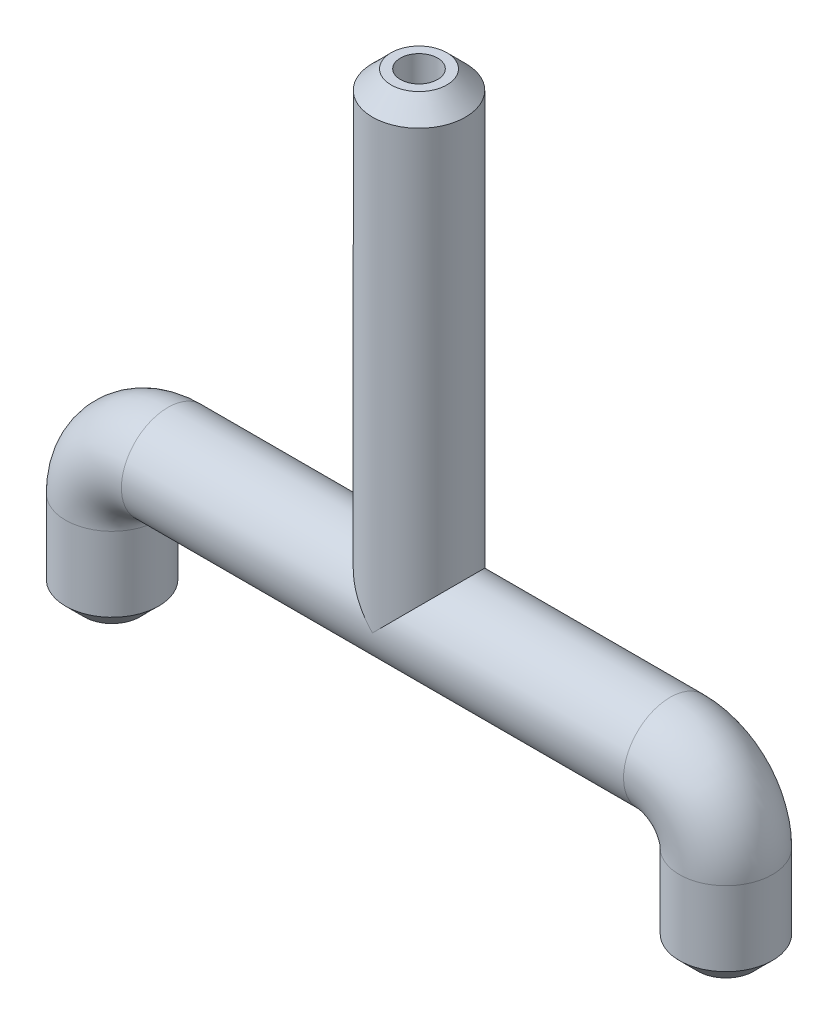
ISO-10303-21;
HEADER;
FILE_DESCRIPTION(('STEP AP214'),'2;1');
FILE_NAME('part.step','',(''),(''),'','','');
FILE_SCHEMA(('AUTOMOTIVE_DESIGN { 1 0 10303 214 1 1 1 1 }'));
ENDSEC;
DATA;
#1=APPLICATION_CONTEXT('core data for automotive mechanical design processes');
#2=APPLICATION_PROTOCOL_DEFINITION('international standard','automotive_design',2000,#1);
#3=PRODUCT_CONTEXT('',#1,'mechanical');
#4=PRODUCT('Part','Part','',(#3));
#5=PRODUCT_RELATED_PRODUCT_CATEGORY('part','',(#4));
#6=PRODUCT_DEFINITION_FORMATION('','',#4);
#7=PRODUCT_DEFINITION_CONTEXT('part definition',#1,'design');
#8=PRODUCT_DEFINITION('design','',#6,#7);
#9=PRODUCT_DEFINITION_SHAPE('','',#8);
#10=(LENGTH_UNIT() NAMED_UNIT(*) SI_UNIT(.MILLI.,.METRE.));
#11=(NAMED_UNIT(*) PLANE_ANGLE_UNIT() SI_UNIT($,.RADIAN.));
#12=(NAMED_UNIT(*) SI_UNIT($,.STERADIAN.) SOLID_ANGLE_UNIT());
#13=UNCERTAINTY_MEASURE_WITH_UNIT(LENGTH_MEASURE(1.E-05),#10,'distance_accuracy_value','');
#14=(GEOMETRIC_REPRESENTATION_CONTEXT(3) GLOBAL_UNCERTAINTY_ASSIGNED_CONTEXT((#13)) GLOBAL_UNIT_ASSIGNED_CONTEXT((#10,
#11,#12)) REPRESENTATION_CONTEXT('',''));
#15=CARTESIAN_POINT('',(0.,0.,0.));
#16=DIRECTION('',(0.,0.,1.));
#17=DIRECTION('',(1.,0.,0.));
#18=AXIS2_PLACEMENT_3D('',#15,#16,#17);
#19=CARTESIAN_POINT('',(-16.4902224556055,29.75,-8.5));
#20=DIRECTION('',(0.,1.,0.));
#21=DIRECTION('',(0.,0.,1.));
#22=AXIS2_PLACEMENT_3D('',#19,#20,#21);
#23=CYLINDRICAL_SURFACE('',#22,2.5);
#24=CARTESIAN_POINT('',(-16.4902224556055,30.75,-8.5));
#25=DIRECTION('',(0.,1.,0.));
#26=DIRECTION('',(0.,0.,1.));
#27=AXIS2_PLACEMENT_3D('',#24,#25,#26);
#28=CIRCLE('',#27,2.5);
#29=CARTESIAN_POINT('',(-16.4902224556055,30.75,-6.));
#30=VERTEX_POINT('',#29);
#31=EDGE_CURVE('E99',#30,#30,#28,.T.);
#32=ORIENTED_EDGE('',*,*,#31,.T.);
#33=EDGE_LOOP('',(#32));
#34=FACE_BOUND('',#33,.T.);
#35=CARTESIAN_POINT('',(-16.4902224556055,34.75,-8.5));
#36=DIRECTION('',(0.,1.,0.));
#37=DIRECTION('',(0.,0.,-1.));
#38=AXIS2_PLACEMENT_3D('',#35,#36,#37);
#39=CIRCLE('',#38,2.5);
#40=CARTESIAN_POINT('',(-18.9902224556055,34.75,-8.5));
#41=VERTEX_POINT('',#40);
#42=EDGE_CURVE('E79',#41,#41,#39,.T.);
#43=ORIENTED_EDGE('',*,*,#42,.F.);
#44=EDGE_LOOP('',(#43));
#45=FACE_BOUND('',#44,.T.);
#46=ADVANCED_FACE('F34',(#34,#45),#23,.T.);
#47=CARTESIAN_POINT('',(-13.4902224556055,34.75,-8.5));
#48=DIRECTION('',(0.,0.,-1.));
#49=DIRECTION('',(-1.,0.,0.));
#50=AXIS2_PLACEMENT_3D('',#47,#48,#49);
#51=TOROIDAL_SURFACE('',#50,3.,2.5);
#52=CARTESIAN_POINT('',(-13.4902224556055,37.75,-8.5));
#53=DIRECTION('',(1.,0.,0.));
#54=DIRECTION('',(0.,0.,-1.));
#55=AXIS2_PLACEMENT_3D('',#52,#53,#54);
#56=CIRCLE('',#55,2.5);
#57=CARTESIAN_POINT('',(-13.4902224556055,40.25,-8.5));
#58=VERTEX_POINT('',#57);
#59=EDGE_CURVE('E102',#58,#58,#56,.T.);
#60=CARTESIAN_POINT('',(-13.4902224556055,34.75,-8.5));
#61=DIRECTION('',(0.,0.,-1.));
#62=DIRECTION('',(-1.,0.,0.));
#63=AXIS2_PLACEMENT_3D('',#60,#61,#62);
#64=CIRCLE('',#63,5.5);
#65=EDGE_CURVE('',#41,#58,#64,.T.);
#66=ORIENTED_EDGE('',*,*,#42,.T.);
#67=ORIENTED_EDGE('',*,*,#59,.F.);
#68=ORIENTED_EDGE('',*,*,#65,.T.);
#69=ORIENTED_EDGE('',*,*,#65,.F.);
#70=EDGE_LOOP('',(#66,#68,#67,#69));
#71=FACE_BOUND('',#70,.T.);
#72=ADVANCED_FACE('F164',(#71),#51,.T.);
#73=CARTESIAN_POINT('',(-13.4902224556055,37.75,-8.5));
#74=DIRECTION('',(1.,0.,0.));
#75=DIRECTION('',(0.,0.,-1.));
#76=AXIS2_PLACEMENT_3D('',#73,#74,#75);
#77=CYLINDRICAL_SURFACE('',#76,2.5);
#78=CARTESIAN_POINT('',(0.,37.75,-8.5));
#79=DIRECTION('',(0.707106781186547,0.707106781186547,0.));
#80=DIRECTION('',(-0.707106781186547,0.707106781186547,0.));
#81=AXIS2_PLACEMENT_3D('',#78,#79,#80);
#82=ELLIPSE('',#81,3.53553390593274,2.5);
#83=CARTESIAN_POINT('',(0.,37.75,-6.));
#84=VERTEX_POINT('',#83);
#85=CARTESIAN_POINT('',(0.,37.75,-11.));
#86=VERTEX_POINT('',#85);
#87=EDGE_CURVE('E73',#84,#86,#82,.F.);
#88=ORIENTED_EDGE('',*,*,#87,.T.);
#89=CARTESIAN_POINT('',(0.,37.75,-8.5));
#90=DIRECTION('',(-0.707106781186547,0.707106781186547,0.));
#91=DIRECTION('',(0.707106781186547,0.707106781186547,0.));
#92=AXIS2_PLACEMENT_3D('',#89,#90,#91);
#93=ELLIPSE('',#92,3.53553390593274,2.5);
#94=EDGE_CURVE('E55',#86,#84,#93,.F.);
#95=ORIENTED_EDGE('',*,*,#94,.T.);
#96=EDGE_LOOP('',(#88,#95));
#97=FACE_BOUND('',#96,.T.);
#98=CARTESIAN_POINT('',(13.4902224556055,37.75,-8.5));
#99=DIRECTION('',(1.,0.,0.));
#100=DIRECTION('',(0.,0.,-1.));
#101=AXIS2_PLACEMENT_3D('',#98,#99,#100);
#102=CIRCLE('',#101,2.5);
#103=CARTESIAN_POINT('',(13.4902224556055,40.25,-8.5));
#104=VERTEX_POINT('',#103);
#105=EDGE_CURVE('E105',#104,#104,#102,.T.);
#106=ORIENTED_EDGE('',*,*,#105,.F.);
#107=EDGE_LOOP('',(#106));
#108=FACE_BOUND('',#107,.T.);
#109=ORIENTED_EDGE('',*,*,#59,.T.);
#110=EDGE_LOOP('',(#109));
#111=FACE_BOUND('',#110,.T.);
#112=ADVANCED_FACE('F168',(#97,#108,#111),#77,.T.);
#113=CARTESIAN_POINT('',(13.4902224556055,34.75,-8.5));
#114=DIRECTION('',(0.,0.,-1.));
#115=DIRECTION('',(-1.,0.,0.));
#116=AXIS2_PLACEMENT_3D('',#113,#114,#115);
#117=TOROIDAL_SURFACE('',#116,3.,2.5);
#118=CARTESIAN_POINT('',(16.4902224556055,34.75,-8.5));
#119=DIRECTION('',(0.,-1.,0.));
#120=DIRECTION('',(0.,0.,-1.));
#121=AXIS2_PLACEMENT_3D('',#118,#119,#120);
#122=CIRCLE('',#121,2.5);
#123=CARTESIAN_POINT('',(18.9902224556055,34.75,-8.5));
#124=VERTEX_POINT('',#123);
#125=EDGE_CURVE('E85',#124,#124,#122,.T.);
#126=CARTESIAN_POINT('',(13.4902224556055,34.75,-8.5));
#127=DIRECTION('',(0.,0.,-1.));
#128=DIRECTION('',(-1.,0.,0.));
#129=AXIS2_PLACEMENT_3D('',#126,#127,#128);
#130=CIRCLE('',#129,5.5);
#131=EDGE_CURVE('',#104,#124,#130,.T.);
#132=ORIENTED_EDGE('',*,*,#105,.T.);
#133=ORIENTED_EDGE('',*,*,#125,.F.);
#134=ORIENTED_EDGE('',*,*,#131,.T.);
#135=ORIENTED_EDGE('',*,*,#131,.F.);
#136=EDGE_LOOP('',(#132,#134,#133,#135));
#137=FACE_BOUND('',#136,.T.);
#138=ADVANCED_FACE('F172',(#137),#117,.T.);
#139=CARTESIAN_POINT('',(16.4902224556055,34.75,-8.5));
#140=DIRECTION('',(0.,-1.,0.));
#141=DIRECTION('',(0.,0.,-1.));
#142=AXIS2_PLACEMENT_3D('',#139,#140,#141);
#143=CYLINDRICAL_SURFACE('',#142,2.5);
#144=CARTESIAN_POINT('',(16.4902224556055,30.75,-8.5));
#145=DIRECTION('',(0.,-1.,0.));
#146=DIRECTION('',(0.,0.,-1.));
#147=AXIS2_PLACEMENT_3D('',#144,#145,#146);
#148=CIRCLE('',#147,2.5);
#149=CARTESIAN_POINT('',(16.4902224556055,30.75,-11.));
#150=VERTEX_POINT('',#149);
#151=EDGE_CURVE('E118',#150,#150,#148,.F.);
#152=ORIENTED_EDGE('',*,*,#151,.T.);
#153=EDGE_LOOP('',(#152));
#154=FACE_BOUND('',#153,.T.);
#155=ORIENTED_EDGE('',*,*,#125,.T.);
#156=EDGE_LOOP('',(#155));
#157=FACE_BOUND('',#156,.T.);
#158=ADVANCED_FACE('F160',(#154,#157),#143,.T.);
#159=CARTESIAN_POINT('',(-16.4902224556055,29.75,-8.5));
#160=DIRECTION('',(0.,1.,0.));
#161=DIRECTION('',(0.,0.,-1.));
#162=AXIS2_PLACEMENT_3D('',#159,#160,#161);
#163=PLANE('',#162);
#164=CARTESIAN_POINT('',(-16.4902224556055,29.75,-8.5));
#165=DIRECTION('',(0.,1.,0.));
#166=DIRECTION('',(0.,0.,1.));
#167=AXIS2_PLACEMENT_3D('',#164,#165,#166);
#168=CIRCLE('',#167,1.5);
#169=CARTESIAN_POINT('',(-16.4902224556055,29.75,-7.));
#170=VERTEX_POINT('',#169);
#171=EDGE_CURVE('E112',#170,#170,#168,.F.);
#172=ORIENTED_EDGE('',*,*,#171,.T.);
#173=EDGE_LOOP('',(#172));
#174=FACE_BOUND('',#173,.T.);
#175=CARTESIAN_POINT('',(-16.4902224556055,29.75,-8.5));
#176=DIRECTION('',(0.,1.,0.));
#177=DIRECTION('',(0.,0.,-1.));
#178=AXIS2_PLACEMENT_3D('',#175,#176,#177);
#179=CIRCLE('',#178,1.);
#180=CARTESIAN_POINT('',(-16.4902224556055,29.75,-9.50000000000001));
#181=VERTEX_POINT('',#180);
#182=EDGE_CURVE('E81',#181,#181,#179,.F.);
#183=ORIENTED_EDGE('',*,*,#182,.F.);
#184=EDGE_LOOP('',(#183));
#185=FACE_BOUND('',#184,.T.);
#186=ADVANCED_FACE('F156',(#174,#185),#163,.F.);
#187=CARTESIAN_POINT('',(16.4902224556055,29.75,-8.5));
#188=DIRECTION('',(0.,-1.,0.));
#189=DIRECTION('',(0.,0.,-1.));
#190=AXIS2_PLACEMENT_3D('',#187,#188,#189);
#191=PLANE('',#190);
#192=CARTESIAN_POINT('',(16.4902224556055,29.75,-8.5));
#193=DIRECTION('',(0.,-1.,0.));
#194=DIRECTION('',(0.,0.,-1.));
#195=AXIS2_PLACEMENT_3D('',#192,#193,#194);
#196=CIRCLE('',#195,1.49999999999999);
#197=CARTESIAN_POINT('',(16.4902224556055,29.75,-10.));
#198=VERTEX_POINT('',#197);
#199=EDGE_CURVE('E115',#198,#198,#196,.T.);
#200=ORIENTED_EDGE('',*,*,#199,.T.);
#201=EDGE_LOOP('',(#200));
#202=FACE_BOUND('',#201,.T.);
#203=CARTESIAN_POINT('',(16.4902224556055,29.75,-8.5));
#204=DIRECTION('',(0.,-1.,0.));
#205=DIRECTION('',(0.,0.,-1.));
#206=AXIS2_PLACEMENT_3D('',#203,#204,#205);
#207=CIRCLE('',#206,1.);
#208=CARTESIAN_POINT('',(16.4902224556055,29.75,-9.50000000000001));
#209=VERTEX_POINT('',#208);
#210=EDGE_CURVE('E97',#209,#209,#207,.F.);
#211=ORIENTED_EDGE('',*,*,#210,.T.);
#212=EDGE_LOOP('',(#211));
#213=FACE_BOUND('',#212,.T.);
#214=ADVANCED_FACE('F152',(#202,#213),#191,.T.);
#215=CARTESIAN_POINT('',(-16.4902224556055,29.75,-8.5));
#216=DIRECTION('',(0.,1.,0.));
#217=DIRECTION('',(0.,0.,1.));
#218=AXIS2_PLACEMENT_3D('',#215,#216,#217);
#219=CYLINDRICAL_SURFACE('',#218,1.);
#220=CARTESIAN_POINT('',(-16.4902224556055,34.75,-8.5));
#221=DIRECTION('',(0.,1.,0.));
#222=DIRECTION('',(0.,0.,-1.));
#223=AXIS2_PLACEMENT_3D('',#220,#221,#222);
#224=CIRCLE('',#223,1.);
#225=CARTESIAN_POINT('',(-17.4902224556055,34.75,-8.5));
#226=VERTEX_POINT('',#225);
#227=EDGE_CURVE('E84',#226,#226,#224,.F.);
#228=ORIENTED_EDGE('',*,*,#227,.F.);
#229=EDGE_LOOP('',(#228));
#230=FACE_BOUND('',#229,.T.);
#231=ORIENTED_EDGE('',*,*,#182,.T.);
#232=EDGE_LOOP('',(#231));
#233=FACE_BOUND('',#232,.T.);
#234=ADVANCED_FACE('F155',(#230,#233),#219,.F.);
#235=CARTESIAN_POINT('',(-13.4902224556055,34.75,-8.5));
#236=DIRECTION('',(0.,0.,-1.));
#237=DIRECTION('',(-1.,0.,0.));
#238=AXIS2_PLACEMENT_3D('',#235,#236,#237);
#239=TOROIDAL_SURFACE('',#238,3.,1.);
#240=CARTESIAN_POINT('',(-13.4902224556055,37.75,-8.5));
#241=DIRECTION('',(1.,0.,0.));
#242=DIRECTION('',(0.,0.,-1.));
#243=AXIS2_PLACEMENT_3D('',#240,#241,#242);
#244=CIRCLE('',#243,1.);
#245=CARTESIAN_POINT('',(-13.4902224556055,38.75,-8.5));
#246=VERTEX_POINT('',#245);
#247=EDGE_CURVE('E88',#246,#246,#244,.F.);
#248=CARTESIAN_POINT('',(-13.4902224556055,34.75,-8.5));
#249=DIRECTION('',(0.,0.,-1.));
#250=DIRECTION('',(-1.,0.,0.));
#251=AXIS2_PLACEMENT_3D('',#248,#249,#250);
#252=CIRCLE('',#251,4.);
#253=EDGE_CURVE('',#226,#246,#252,.T.);
#254=ORIENTED_EDGE('',*,*,#227,.T.);
#255=ORIENTED_EDGE('',*,*,#247,.F.);
#256=ORIENTED_EDGE('',*,*,#253,.T.);
#257=ORIENTED_EDGE('',*,*,#253,.F.);
#258=EDGE_LOOP('',(#254,#256,#255,#257));
#259=FACE_BOUND('',#258,.T.);
#260=ADVANCED_FACE('F195',(#259),#239,.F.);
#261=CARTESIAN_POINT('',(-13.4902224556055,37.75,-8.5));
#262=DIRECTION('',(1.,0.,0.));
#263=DIRECTION('',(0.,0.,-1.));
#264=AXIS2_PLACEMENT_3D('',#261,#262,#263);
#265=CYLINDRICAL_SURFACE('',#264,1.);
#266=CARTESIAN_POINT('',(0.,37.75,-8.5));
#267=DIRECTION('',(0.707106781186547,0.707106781186547,0.));
#268=DIRECTION('',(-0.707106781186547,0.707106781186547,0.));
#269=AXIS2_PLACEMENT_3D('',#266,#267,#268);
#270=ELLIPSE('',#269,1.4142135623731,1.);
#271=CARTESIAN_POINT('',(0.,37.75,-9.5));
#272=VERTEX_POINT('',#271);
#273=CARTESIAN_POINT('',(0.,37.75,-7.5));
#274=VERTEX_POINT('',#273);
#275=EDGE_CURVE('E48',#272,#274,#270,.T.);
#276=ORIENTED_EDGE('',*,*,#275,.T.);
#277=CARTESIAN_POINT('',(0.,37.75,-8.5));
#278=DIRECTION('',(-0.707106781186547,0.707106781186547,0.));
#279=DIRECTION('',(0.707106781186547,0.707106781186547,0.));
#280=AXIS2_PLACEMENT_3D('',#277,#278,#279);
#281=ELLIPSE('',#280,1.4142135623731,1.);
#282=EDGE_CURVE('E66',#274,#272,#281,.T.);
#283=ORIENTED_EDGE('',*,*,#282,.T.);
#284=EDGE_LOOP('',(#276,#283));
#285=FACE_BOUND('',#284,.T.);
#286=CARTESIAN_POINT('',(13.4902224556055,37.75,-8.5));
#287=DIRECTION('',(1.,0.,0.));
#288=DIRECTION('',(0.,0.,-1.));
#289=AXIS2_PLACEMENT_3D('',#286,#287,#288);
#290=CIRCLE('',#289,1.);
#291=CARTESIAN_POINT('',(13.4902224556055,38.75,-8.5));
#292=VERTEX_POINT('',#291);
#293=EDGE_CURVE('E91',#292,#292,#290,.F.);
#294=ORIENTED_EDGE('',*,*,#293,.F.);
#295=EDGE_LOOP('',(#294));
#296=FACE_BOUND('',#295,.T.);
#297=ORIENTED_EDGE('',*,*,#247,.T.);
#298=EDGE_LOOP('',(#297));
#299=FACE_BOUND('',#298,.T.);
#300=ADVANCED_FACE('F70',(#285,#296,#299),#265,.F.);
#301=CARTESIAN_POINT('',(13.4902224556055,34.75,-8.5));
#302=DIRECTION('',(0.,0.,-1.));
#303=DIRECTION('',(-1.,0.,0.));
#304=AXIS2_PLACEMENT_3D('',#301,#302,#303);
#305=TOROIDAL_SURFACE('',#304,3.,1.);
#306=CARTESIAN_POINT('',(16.4902224556055,34.75,-8.5));
#307=DIRECTION('',(0.,-1.,0.));
#308=DIRECTION('',(0.,0.,-1.));
#309=AXIS2_PLACEMENT_3D('',#306,#307,#308);
#310=CIRCLE('',#309,1.);
#311=CARTESIAN_POINT('',(17.4902224556055,34.75,-8.5));
#312=VERTEX_POINT('',#311);
#313=EDGE_CURVE('E94',#312,#312,#310,.F.);
#314=CARTESIAN_POINT('',(13.4902224556055,34.75,-8.5));
#315=DIRECTION('',(0.,0.,-1.));
#316=DIRECTION('',(-1.,0.,0.));
#317=AXIS2_PLACEMENT_3D('',#314,#315,#316);
#318=CIRCLE('',#317,4.00000000000001);
#319=EDGE_CURVE('',#292,#312,#318,.T.);
#320=ORIENTED_EDGE('',*,*,#293,.T.);
#321=ORIENTED_EDGE('',*,*,#313,.F.);
#322=ORIENTED_EDGE('',*,*,#319,.T.);
#323=ORIENTED_EDGE('',*,*,#319,.F.);
#324=EDGE_LOOP('',(#320,#322,#321,#323));
#325=FACE_BOUND('',#324,.T.);
#326=ADVANCED_FACE('F137',(#325),#305,.F.);
#327=CARTESIAN_POINT('',(16.4902224556055,34.75,-8.5));
#328=DIRECTION('',(0.,-1.,0.));
#329=DIRECTION('',(0.,0.,-1.));
#330=AXIS2_PLACEMENT_3D('',#327,#328,#329);
#331=CYLINDRICAL_SURFACE('',#330,1.);
#332=ORIENTED_EDGE('',*,*,#210,.F.);
#333=EDGE_LOOP('',(#332));
#334=FACE_BOUND('',#333,.T.);
#335=ORIENTED_EDGE('',*,*,#313,.T.);
#336=EDGE_LOOP('',(#335));
#337=FACE_BOUND('',#336,.T.);
#338=ADVANCED_FACE('F135',(#334,#337),#331,.F.);
#339=CARTESIAN_POINT('',(0.,62.75,-8.5));
#340=DIRECTION('',(0.,1.,0.));
#341=DIRECTION('',(0.,0.,1.));
#342=AXIS2_PLACEMENT_3D('',#339,#340,#341);
#343=PLANE('',#342);
#344=CARTESIAN_POINT('',(0.,62.75,-8.5));
#345=DIRECTION('',(0.,1.,0.));
#346=DIRECTION('',(0.,0.,1.));
#347=AXIS2_PLACEMENT_3D('',#344,#345,#346);
#348=CIRCLE('',#347,1.5);
#349=CARTESIAN_POINT('',(0.,62.75,-7.));
#350=VERTEX_POINT('',#349);
#351=EDGE_CURVE('E42',#350,#350,#348,.T.);
#352=ORIENTED_EDGE('',*,*,#351,.T.);
#353=EDGE_LOOP('',(#352));
#354=FACE_BOUND('',#353,.T.);
#355=CARTESIAN_POINT('',(0.,62.75,-8.5));
#356=DIRECTION('',(0.,1.,0.));
#357=DIRECTION('',(0.,0.,1.));
#358=AXIS2_PLACEMENT_3D('',#355,#356,#357);
#359=CIRCLE('',#358,1.);
#360=CARTESIAN_POINT('',(0.,62.75,-7.5));
#361=VERTEX_POINT('',#360);
#362=EDGE_CURVE('E76',#361,#361,#359,.T.);
#363=ORIENTED_EDGE('',*,*,#362,.F.);
#364=EDGE_LOOP('',(#363));
#365=FACE_BOUND('',#364,.T.);
#366=ADVANCED_FACE('F123',(#354,#365),#343,.T.);
#367=CARTESIAN_POINT('',(0.,29.748,-8.5));
#368=DIRECTION('',(0.,1.,0.));
#369=DIRECTION('',(0.,0.,1.));
#370=AXIS2_PLACEMENT_3D('',#367,#368,#369);
#371=CYLINDRICAL_SURFACE('',#370,2.5);
#372=CARTESIAN_POINT('',(0.,61.75,-8.5));
#373=DIRECTION('',(0.,1.,0.));
#374=DIRECTION('',(0.,0.,1.));
#375=AXIS2_PLACEMENT_3D('',#372,#373,#374);
#376=CIRCLE('',#375,2.5);
#377=CARTESIAN_POINT('',(0.,61.75,-6.));
#378=VERTEX_POINT('',#377);
#379=EDGE_CURVE('E11',#378,#378,#376,.F.);
#380=ORIENTED_EDGE('',*,*,#379,.T.);
#381=EDGE_LOOP('',(#380));
#382=FACE_BOUND('',#381,.T.);
#383=ORIENTED_EDGE('',*,*,#87,.F.);
#384=ORIENTED_EDGE('',*,*,#94,.F.);
#385=EDGE_LOOP('',(#383,#384));
#386=FACE_BOUND('',#385,.T.);
#387=ADVANCED_FACE('F144',(#382,#386),#371,.T.);
#388=CARTESIAN_POINT('',(0.,29.748,-8.5));
#389=DIRECTION('',(0.,1.,0.));
#390=DIRECTION('',(0.,0.,1.));
#391=AXIS2_PLACEMENT_3D('',#388,#389,#390);
#392=CYLINDRICAL_SURFACE('',#391,1.);
#393=ORIENTED_EDGE('',*,*,#362,.T.);
#394=EDGE_LOOP('',(#393));
#395=FACE_BOUND('',#394,.T.);
#396=ORIENTED_EDGE('',*,*,#282,.F.);
#397=ORIENTED_EDGE('',*,*,#275,.F.);
#398=EDGE_LOOP('',(#396,#397));
#399=FACE_BOUND('',#398,.T.);
#400=ADVANCED_FACE('F67',(#395,#399),#392,.F.);
#401=CARTESIAN_POINT('',(-16.4902224556055,30.75,-8.5));
#402=DIRECTION('',(0.,1.,0.));
#403=DIRECTION('',(0.,0.,1.));
#404=AXIS2_PLACEMENT_3D('',#401,#402,#403);
#405=CONICAL_SURFACE('',#404,2.5,0.785398163397449);
#406=ORIENTED_EDGE('',*,*,#171,.F.);
#407=EDGE_LOOP('',(#406));
#408=FACE_BOUND('',#407,.T.);
#409=ORIENTED_EDGE('',*,*,#31,.F.);
#410=EDGE_LOOP('',(#409));
#411=FACE_BOUND('',#410,.T.);
#412=ADVANCED_FACE('F132',(#408,#411),#405,.T.);
#413=CARTESIAN_POINT('',(16.4902224556055,29.75,-8.5));
#414=DIRECTION('',(0.,1.,0.));
#415=DIRECTION('',(0.,0.,1.));
#416=AXIS2_PLACEMENT_3D('',#413,#414,#415);
#417=CONICAL_SURFACE('',#416,1.49999999999999,0.785398163397448);
#418=ORIENTED_EDGE('',*,*,#151,.F.);
#419=EDGE_LOOP('',(#418));
#420=FACE_BOUND('',#419,.T.);
#421=ORIENTED_EDGE('',*,*,#199,.F.);
#422=EDGE_LOOP('',(#421));
#423=FACE_BOUND('',#422,.T.);
#424=ADVANCED_FACE('F127',(#420,#423),#417,.T.);
#425=CARTESIAN_POINT('',(0.,62.75,-8.5));
#426=DIRECTION('',(0.,-1.,0.));
#427=DIRECTION('',(0.,0.,-1.));
#428=AXIS2_PLACEMENT_3D('',#425,#426,#427);
#429=CONICAL_SURFACE('',#428,1.5,0.785398163397445);
#430=ORIENTED_EDGE('',*,*,#379,.F.);
#431=EDGE_LOOP('',(#430));
#432=FACE_BOUND('',#431,.T.);
#433=ORIENTED_EDGE('',*,*,#351,.F.);
#434=EDGE_LOOP('',(#433));
#435=FACE_BOUND('',#434,.T.);
#436=ADVANCED_FACE('F36',(#432,#435),#429,.T.);
#437=CLOSED_SHELL('',(#46,#72,#112,#138,#158,#186,#214,#234,#260,#300,#326,#338,#366,#387,#400,
#412,#424,#436));
#438=MANIFOLD_SOLID_BREP('B2',#437);
#439=ADVANCED_BREP_SHAPE_REPRESENTATION('',(#18,#438),#14);
#440=SHAPE_DEFINITION_REPRESENTATION(#9,#439);
ENDSEC;
END-ISO-10303-21;
